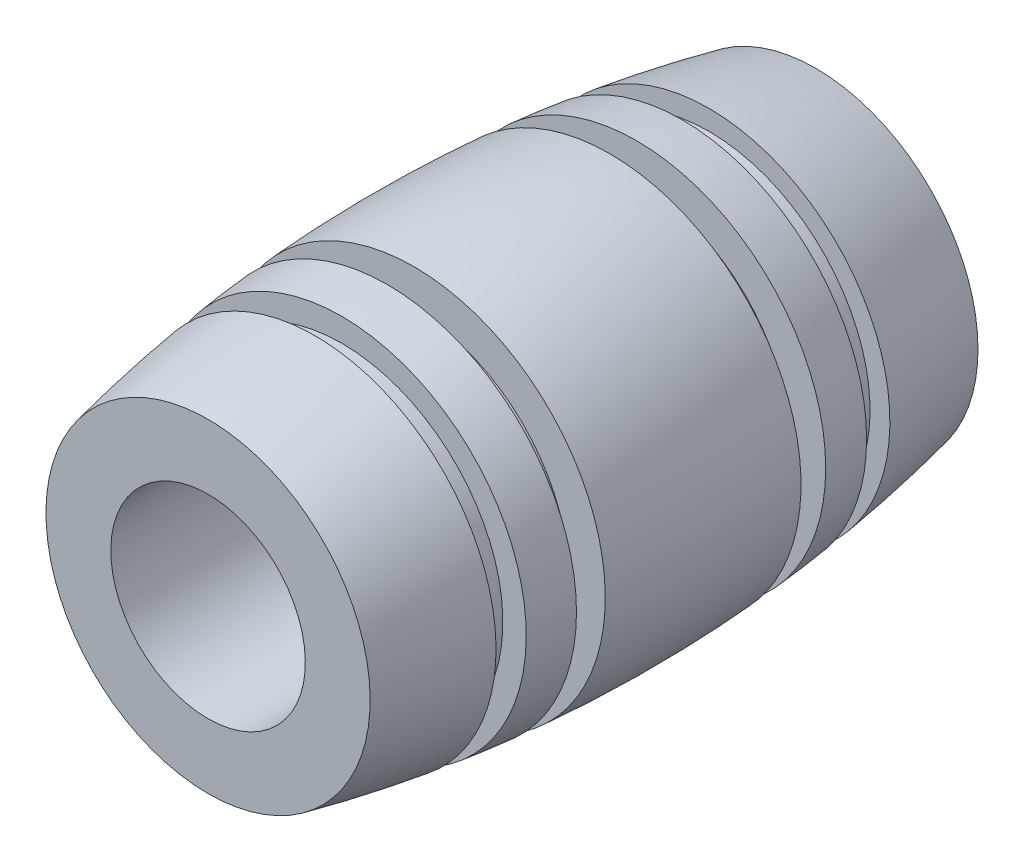
ISO-10303-21;
HEADER;
FILE_DESCRIPTION(('STEP AP214'),'2;1');
FILE_NAME('part.step','',(''),(''),'','','');
FILE_SCHEMA(('AUTOMOTIVE_DESIGN { 1 0 10303 214 1 1 1 1 }'));
ENDSEC;
DATA;
#1=APPLICATION_CONTEXT('core data for automotive mechanical design processes');
#2=APPLICATION_PROTOCOL_DEFINITION('international standard','automotive_design',2000,#1);
#3=PRODUCT_CONTEXT('',#1,'mechanical');
#4=PRODUCT('Part','Part','',(#3));
#5=PRODUCT_RELATED_PRODUCT_CATEGORY('part','',(#4));
#6=PRODUCT_DEFINITION_FORMATION('','',#4);
#7=PRODUCT_DEFINITION_CONTEXT('part definition',#1,'design');
#8=PRODUCT_DEFINITION('design','',#6,#7);
#9=PRODUCT_DEFINITION_SHAPE('','',#8);
#10=(LENGTH_UNIT() NAMED_UNIT(*) SI_UNIT(.MILLI.,.METRE.));
#11=(NAMED_UNIT(*) PLANE_ANGLE_UNIT() SI_UNIT($,.RADIAN.));
#12=(NAMED_UNIT(*) SI_UNIT($,.STERADIAN.) SOLID_ANGLE_UNIT());
#13=UNCERTAINTY_MEASURE_WITH_UNIT(LENGTH_MEASURE(1.E-05),#10,'distance_accuracy_value','');
#14=(GEOMETRIC_REPRESENTATION_CONTEXT(3) GLOBAL_UNCERTAINTY_ASSIGNED_CONTEXT((#13)) GLOBAL_UNIT_ASSIGNED_CONTEXT((#10,
#11,#12)) REPRESENTATION_CONTEXT('',''));
#15=CARTESIAN_POINT('',(0.,0.,0.));
#16=DIRECTION('',(0.,0.,1.));
#17=DIRECTION('',(1.,0.,0.));
#18=AXIS2_PLACEMENT_3D('',#15,#16,#17);
#19=CARTESIAN_POINT('',(0.,0.,0.));
#20=DIRECTION('',(0.,0.,1.));
#21=DIRECTION('',(0.,-1.,0.));
#22=AXIS2_PLACEMENT_3D('',#19,#20,#21);
#23=DEGENERATE_TOROIDAL_SURFACE('',#22,51.2604166666642,59.2604166666642,.F.);
#24=CARTESIAN_POINT('',(0.,0.,8.10000000000001));
#25=DIRECTION('',(0.,0.,1.));
#26=DIRECTION('',(0.,-1.,0.));
#27=AXIS2_PLACEMENT_3D('',#24,#25,#26);
#28=CIRCLE('',#27,7.44381643033361);
#29=CARTESIAN_POINT('',(0.,-7.44381643033362,8.10000000000001));
#30=VERTEX_POINT('',#29);
#31=EDGE_CURVE('E34',#30,#30,#28,.T.);
#32=ORIENTED_EDGE('',*,*,#31,.T.);
#33=EDGE_LOOP('',(#32));
#34=FACE_BOUND('',#33,.T.);
#35=CARTESIAN_POINT('',(0.,0.,12.5));
#36=DIRECTION('',(0.,0.,1.));
#37=DIRECTION('',(0.,-1.,0.));
#38=AXIS2_PLACEMENT_3D('',#35,#36,#37);
#39=CIRCLE('',#38,6.6666666666666);
#40=CARTESIAN_POINT('',(0.,-6.6666666666666,12.5));
#41=VERTEX_POINT('',#40);
#42=EDGE_CURVE('E70',#41,#41,#39,.T.);
#43=ORIENTED_EDGE('',*,*,#42,.F.);
#44=EDGE_LOOP('',(#43));
#45=FACE_BOUND('',#44,.T.);
#46=ADVANCED_FACE('F30',(#34,#45),#23,.F.);
#47=CARTESIAN_POINT('',(0.,0.,-8.09999999999999));
#48=DIRECTION('',(0.,0.,-1.));
#49=DIRECTION('',(0.,1.,0.));
#50=AXIS2_PLACEMENT_3D('',#47,#48,#49);
#51=CIRCLE('',#50,7.44381643033364);
#52=CARTESIAN_POINT('',(0.,7.44381643033364,-8.09999999999999));
#53=VERTEX_POINT('',#52);
#54=EDGE_CURVE('E60',#53,#53,#51,.T.);
#55=ORIENTED_EDGE('',*,*,#54,.T.);
#56=EDGE_LOOP('',(#55));
#57=FACE_BOUND('',#56,.T.);
#58=CARTESIAN_POINT('',(0.,0.,-12.5));
#59=DIRECTION('',(0.,0.,1.));
#60=DIRECTION('',(0.,-1.,0.));
#61=AXIS2_PLACEMENT_3D('',#58,#59,#60);
#62=CIRCLE('',#61,6.66666666666667);
#63=CARTESIAN_POINT('',(0.,-6.66666666666666,-12.5));
#64=VERTEX_POINT('',#63);
#65=EDGE_CURVE('E10',#64,#64,#62,.T.);
#66=ORIENTED_EDGE('',*,*,#65,.T.);
#67=EDGE_LOOP('',(#66));
#68=FACE_BOUND('',#67,.T.);
#69=ADVANCED_FACE('F121',(#57,#68),#23,.F.);
#70=CARTESIAN_POINT('',(0.,4.,-12.5));
#71=DIRECTION('',(0.,0.,1.));
#72=DIRECTION('',(0.,-1.,0.));
#73=AXIS2_PLACEMENT_3D('',#70,#71,#72);
#74=PLANE('',#73);
#75=ORIENTED_EDGE('',*,*,#65,.F.);
#76=EDGE_LOOP('',(#75));
#77=FACE_BOUND('',#76,.T.);
#78=CARTESIAN_POINT('',(0.,0.,-12.5));
#79=DIRECTION('',(0.,0.,1.));
#80=DIRECTION('',(0.,-1.,0.));
#81=AXIS2_PLACEMENT_3D('',#78,#79,#80);
#82=CIRCLE('',#81,4.);
#83=CARTESIAN_POINT('',(0.,-3.99999999999999,-12.5));
#84=VERTEX_POINT('',#83);
#85=EDGE_CURVE('E38',#84,#84,#82,.T.);
#86=ORIENTED_EDGE('',*,*,#85,.T.);
#87=EDGE_LOOP('',(#86));
#88=FACE_BOUND('',#87,.T.);
#89=ADVANCED_FACE('F126',(#77,#88),#74,.F.);
#90=CARTESIAN_POINT('',(0.,0.,12.5));
#91=DIRECTION('',(0.,0.,1.));
#92=DIRECTION('',(0.,-1.,0.));
#93=AXIS2_PLACEMENT_3D('',#90,#91,#92);
#94=CYLINDRICAL_SURFACE('',#93,4.);
#95=ORIENTED_EDGE('',*,*,#85,.F.);
#96=EDGE_LOOP('',(#95));
#97=FACE_BOUND('',#96,.T.);
#98=CARTESIAN_POINT('',(0.,0.,12.5));
#99=DIRECTION('',(0.,0.,1.));
#100=DIRECTION('',(0.,-1.,0.));
#101=AXIS2_PLACEMENT_3D('',#98,#99,#100);
#102=CIRCLE('',#101,4.);
#103=CARTESIAN_POINT('',(0.,-4.,12.5));
#104=VERTEX_POINT('',#103);
#105=EDGE_CURVE('E43',#104,#104,#102,.T.);
#106=ORIENTED_EDGE('',*,*,#105,.T.);
#107=EDGE_LOOP('',(#106));
#108=FACE_BOUND('',#107,.T.);
#109=ADVANCED_FACE('F164',(#97,#108),#94,.F.);
#110=CARTESIAN_POINT('',(0.,6.6666666666666,12.5));
#111=DIRECTION('',(0.,0.,-1.));
#112=DIRECTION('',(0.,1.,0.));
#113=AXIS2_PLACEMENT_3D('',#110,#111,#112);
#114=PLANE('',#113);
#115=ORIENTED_EDGE('',*,*,#105,.F.);
#116=EDGE_LOOP('',(#115));
#117=FACE_BOUND('',#116,.T.);
#118=ORIENTED_EDGE('',*,*,#42,.T.);
#119=EDGE_LOOP('',(#118));
#120=FACE_BOUND('',#119,.T.);
#121=ADVANCED_FACE('F160',(#117,#120),#114,.F.);
#122=CARTESIAN_POINT('',(0.,-8.,-7.));
#123=DIRECTION('',(0.,0.,1.));
#124=DIRECTION('',(0.,-1.,0.));
#125=AXIS2_PLACEMENT_3D('',#122,#123,#124);
#126=PLANE('',#125);
#127=CARTESIAN_POINT('',(0.,0.,-7.));
#128=DIRECTION('',(0.,0.,1.));
#129=DIRECTION('',(0.,-1.,0.));
#130=AXIS2_PLACEMENT_3D('',#127,#128,#129);
#131=CIRCLE('',#130,6.625);
#132=CARTESIAN_POINT('',(0.,-6.625,-7.));
#133=VERTEX_POINT('',#132);
#134=EDGE_CURVE('E92',#133,#133,#131,.T.);
#135=ORIENTED_EDGE('',*,*,#134,.T.);
#136=EDGE_LOOP('',(#135));
#137=FACE_BOUND('',#136,.T.);
#138=CARTESIAN_POINT('',(0.,0.,-6.99999999999999));
#139=DIRECTION('',(0.,0.,1.));
#140=DIRECTION('',(0.,-1.,0.));
#141=AXIS2_PLACEMENT_3D('',#138,#139,#140);
#142=CIRCLE('',#141,7.58511828295331);
#143=CARTESIAN_POINT('',(0.,-7.58511828295331,-7.));
#144=VERTEX_POINT('',#143);
#145=EDGE_CURVE('E63',#144,#144,#142,.T.);
#146=ORIENTED_EDGE('',*,*,#145,.F.);
#147=EDGE_LOOP('',(#146));
#148=FACE_BOUND('',#147,.T.);
#149=ADVANCED_FACE('F163',(#137,#148),#126,.F.);
#150=CARTESIAN_POINT('',(0.,-8.,-8.1));
#151=DIRECTION('',(0.,0.,-1.));
#152=DIRECTION('',(0.,1.,0.));
#153=AXIS2_PLACEMENT_3D('',#150,#151,#152);
#154=PLANE('',#153);
#155=CARTESIAN_POINT('',(0.,0.,-8.1));
#156=DIRECTION('',(0.,0.,1.));
#157=DIRECTION('',(0.,-1.,0.));
#158=AXIS2_PLACEMENT_3D('',#155,#156,#157);
#159=CIRCLE('',#158,6.625);
#160=CARTESIAN_POINT('',(0.,-6.625,-8.1));
#161=VERTEX_POINT('',#160);
#162=EDGE_CURVE('E89',#161,#161,#159,.T.);
#163=ORIENTED_EDGE('',*,*,#162,.F.);
#164=EDGE_LOOP('',(#163));
#165=FACE_BOUND('',#164,.T.);
#166=ORIENTED_EDGE('',*,*,#54,.F.);
#167=EDGE_LOOP('',(#166));
#168=FACE_BOUND('',#167,.T.);
#169=ADVANCED_FACE('F192',(#165,#168),#154,.F.);
#170=CARTESIAN_POINT('',(0.,0.,12.5));
#171=DIRECTION('',(0.,0.,1.));
#172=DIRECTION('',(0.,-1.,0.));
#173=AXIS2_PLACEMENT_3D('',#170,#171,#172);
#174=CYLINDRICAL_SURFACE('',#173,6.625);
#175=ORIENTED_EDGE('',*,*,#134,.F.);
#176=EDGE_LOOP('',(#175));
#177=FACE_BOUND('',#176,.T.);
#178=ORIENTED_EDGE('',*,*,#162,.T.);
#179=EDGE_LOOP('',(#178));
#180=FACE_BOUND('',#179,.T.);
#181=ADVANCED_FACE('F117',(#177,#180),#174,.T.);
#182=CARTESIAN_POINT('',(0.,-8.,8.10000000000001));
#183=DIRECTION('',(0.,0.,1.));
#184=DIRECTION('',(0.,-1.,0.));
#185=AXIS2_PLACEMENT_3D('',#182,#183,#184);
#186=PLANE('',#185);
#187=CARTESIAN_POINT('',(0.,0.,8.10000000000001));
#188=DIRECTION('',(0.,0.,1.));
#189=DIRECTION('',(0.,-1.,0.));
#190=AXIS2_PLACEMENT_3D('',#187,#188,#189);
#191=CIRCLE('',#190,6.625);
#192=CARTESIAN_POINT('',(0.,-6.625,8.1));
#193=VERTEX_POINT('',#192);
#194=EDGE_CURVE('E51',#193,#193,#191,.T.);
#195=ORIENTED_EDGE('',*,*,#194,.T.);
#196=EDGE_LOOP('',(#195));
#197=FACE_BOUND('',#196,.T.);
#198=ORIENTED_EDGE('',*,*,#31,.F.);
#199=EDGE_LOOP('',(#198));
#200=FACE_BOUND('',#199,.T.);
#201=ADVANCED_FACE('F108',(#197,#200),#186,.F.);
#202=CARTESIAN_POINT('',(0.,-8.,7.00000000000001));
#203=DIRECTION('',(0.,0.,-1.));
#204=DIRECTION('',(0.,1.,0.));
#205=AXIS2_PLACEMENT_3D('',#202,#203,#204);
#206=PLANE('',#205);
#207=CARTESIAN_POINT('',(0.,0.,7.00000000000001));
#208=DIRECTION('',(0.,0.,1.));
#209=DIRECTION('',(0.,-1.,0.));
#210=AXIS2_PLACEMENT_3D('',#207,#208,#209);
#211=CIRCLE('',#210,6.625);
#212=CARTESIAN_POINT('',(0.,-6.625,7.00000000000001));
#213=VERTEX_POINT('',#212);
#214=EDGE_CURVE('E95',#213,#213,#211,.T.);
#215=ORIENTED_EDGE('',*,*,#214,.F.);
#216=EDGE_LOOP('',(#215));
#217=FACE_BOUND('',#216,.T.);
#218=CARTESIAN_POINT('',(0.,0.,7.00000000000001));
#219=DIRECTION('',(0.,0.,-1.));
#220=DIRECTION('',(0.,1.,0.));
#221=AXIS2_PLACEMENT_3D('',#218,#219,#220);
#222=CIRCLE('',#221,7.58511828295329);
#223=CARTESIAN_POINT('',(0.,7.58511828295329,7.00000000000001));
#224=VERTEX_POINT('',#223);
#225=EDGE_CURVE('E65',#224,#224,#222,.T.);
#226=ORIENTED_EDGE('',*,*,#225,.F.);
#227=EDGE_LOOP('',(#226));
#228=FACE_BOUND('',#227,.T.);
#229=ADVANCED_FACE('F105',(#217,#228),#206,.F.);
#230=CARTESIAN_POINT('',(0.,0.,12.5));
#231=DIRECTION('',(0.,0.,1.));
#232=DIRECTION('',(0.,-1.,0.));
#233=AXIS2_PLACEMENT_3D('',#230,#231,#232);
#234=CYLINDRICAL_SURFACE('',#233,6.625);
#235=ORIENTED_EDGE('',*,*,#194,.F.);
#236=EDGE_LOOP('',(#235));
#237=FACE_BOUND('',#236,.T.);
#238=ORIENTED_EDGE('',*,*,#214,.T.);
#239=EDGE_LOOP('',(#238));
#240=FACE_BOUND('',#239,.T.);
#241=ADVANCED_FACE('F103',(#237,#240),#234,.T.);
#242=ORIENTED_EDGE('',*,*,#225,.T.);
#243=EDGE_LOOP('',(#242));
#244=FACE_BOUND('',#243,.T.);
#245=CARTESIAN_POINT('',(0.,0.,5.12500000000001));
#246=DIRECTION('',(0.,0.,1.));
#247=DIRECTION('',(0.,-1.,0.));
#248=AXIS2_PLACEMENT_3D('',#245,#246,#247);
#249=CIRCLE('',#248,7.77797218759447);
#250=CARTESIAN_POINT('',(0.,-7.77797218759447,5.125));
#251=VERTEX_POINT('',#250);
#252=EDGE_CURVE('E50',#251,#251,#249,.T.);
#253=ORIENTED_EDGE('',*,*,#252,.T.);
#254=EDGE_LOOP('',(#253));
#255=FACE_BOUND('',#254,.T.);
#256=ADVANCED_FACE('F114',(#244,#255),#23,.F.);
#257=ORIENTED_EDGE('',*,*,#145,.T.);
#258=EDGE_LOOP('',(#257));
#259=FACE_BOUND('',#258,.T.);
#260=CARTESIAN_POINT('',(0.,0.,-5.12499999999999));
#261=DIRECTION('',(0.,0.,-1.));
#262=DIRECTION('',(0.,1.,0.));
#263=AXIS2_PLACEMENT_3D('',#260,#261,#262);
#264=CIRCLE('',#263,7.77797218759448);
#265=CARTESIAN_POINT('',(0.,7.77797218759448,-5.12499999999999));
#266=VERTEX_POINT('',#265);
#267=EDGE_CURVE('E57',#266,#266,#264,.T.);
#268=ORIENTED_EDGE('',*,*,#267,.T.);
#269=EDGE_LOOP('',(#268));
#270=FACE_BOUND('',#269,.T.);
#271=ADVANCED_FACE('F122',(#259,#270),#23,.F.);
#272=CARTESIAN_POINT('',(0.,-8.,5.125));
#273=DIRECTION('',(0.,0.,1.));
#274=DIRECTION('',(0.,-1.,0.));
#275=AXIS2_PLACEMENT_3D('',#272,#273,#274);
#276=PLANE('',#275);
#277=CARTESIAN_POINT('',(0.,0.,5.12500000000001));
#278=DIRECTION('',(0.,0.,1.));
#279=DIRECTION('',(0.,-1.,0.));
#280=AXIS2_PLACEMENT_3D('',#277,#278,#279);
#281=CIRCLE('',#280,6.35000000000001);
#282=CARTESIAN_POINT('',(0.,-6.35000000000001,5.125));
#283=VERTEX_POINT('',#282);
#284=EDGE_CURVE('E79',#283,#283,#281,.T.);
#285=ORIENTED_EDGE('',*,*,#284,.T.);
#286=EDGE_LOOP('',(#285));
#287=FACE_BOUND('',#286,.T.);
#288=ORIENTED_EDGE('',*,*,#252,.F.);
#289=EDGE_LOOP('',(#288));
#290=FACE_BOUND('',#289,.T.);
#291=ADVANCED_FACE('F130',(#287,#290),#276,.F.);
#292=CARTESIAN_POINT('',(0.,-8.00000000000001,4.025));
#293=DIRECTION('',(0.,0.,-1.));
#294=DIRECTION('',(0.,1.,0.));
#295=AXIS2_PLACEMENT_3D('',#292,#293,#294);
#296=PLANE('',#295);
#297=CARTESIAN_POINT('',(0.,0.,4.02500000000001));
#298=DIRECTION('',(0.,0.,1.));
#299=DIRECTION('',(0.,-1.,0.));
#300=AXIS2_PLACEMENT_3D('',#297,#298,#299);
#301=CIRCLE('',#300,6.35000000000001);
#302=CARTESIAN_POINT('',(0.,-6.35000000000001,4.025));
#303=VERTEX_POINT('',#302);
#304=EDGE_CURVE('E83',#303,#303,#301,.T.);
#305=ORIENTED_EDGE('',*,*,#304,.F.);
#306=EDGE_LOOP('',(#305));
#307=FACE_BOUND('',#306,.T.);
#308=CARTESIAN_POINT('',(0.,0.,4.02500000000001));
#309=DIRECTION('',(0.,0.,-1.));
#310=DIRECTION('',(0.,1.,0.));
#311=AXIS2_PLACEMENT_3D('',#308,#309,#310);
#312=CIRCLE('',#311,7.86315188688857);
#313=CARTESIAN_POINT('',(0.,7.86315188688857,4.02500000000001));
#314=VERTEX_POINT('',#313);
#315=EDGE_CURVE('E47',#314,#314,#312,.T.);
#316=ORIENTED_EDGE('',*,*,#315,.F.);
#317=EDGE_LOOP('',(#316));
#318=FACE_BOUND('',#317,.T.);
#319=ADVANCED_FACE('F149',(#307,#318),#296,.F.);
#320=CARTESIAN_POINT('',(0.,0.,12.5));
#321=DIRECTION('',(0.,0.,1.));
#322=DIRECTION('',(0.,-1.,0.));
#323=AXIS2_PLACEMENT_3D('',#320,#321,#322);
#324=CYLINDRICAL_SURFACE('',#323,6.35000000000001);
#325=ORIENTED_EDGE('',*,*,#284,.F.);
#326=EDGE_LOOP('',(#325));
#327=FACE_BOUND('',#326,.T.);
#328=ORIENTED_EDGE('',*,*,#304,.T.);
#329=EDGE_LOOP('',(#328));
#330=FACE_BOUND('',#329,.T.);
#331=ADVANCED_FACE('F155',(#327,#330),#324,.T.);
#332=CARTESIAN_POINT('',(0.,-8.,-5.125));
#333=DIRECTION('',(0.,0.,-1.));
#334=DIRECTION('',(0.,1.,0.));
#335=AXIS2_PLACEMENT_3D('',#332,#333,#334);
#336=PLANE('',#335);
#337=CARTESIAN_POINT('',(0.,0.,-5.12499999999999));
#338=DIRECTION('',(0.,0.,1.));
#339=DIRECTION('',(0.,-1.,0.));
#340=AXIS2_PLACEMENT_3D('',#337,#338,#339);
#341=CIRCLE('',#340,6.35000000000002);
#342=CARTESIAN_POINT('',(0.,-6.35000000000002,-5.12499999999999));
#343=VERTEX_POINT('',#342);
#344=EDGE_CURVE('E86',#343,#343,#341,.T.);
#345=ORIENTED_EDGE('',*,*,#344,.F.);
#346=EDGE_LOOP('',(#345));
#347=FACE_BOUND('',#346,.T.);
#348=ORIENTED_EDGE('',*,*,#267,.F.);
#349=EDGE_LOOP('',(#348));
#350=FACE_BOUND('',#349,.T.);
#351=ADVANCED_FACE('F253',(#347,#350),#336,.F.);
#352=CARTESIAN_POINT('',(0.,-8.00000000000001,-4.025));
#353=DIRECTION('',(0.,0.,1.));
#354=DIRECTION('',(0.,-1.,0.));
#355=AXIS2_PLACEMENT_3D('',#352,#353,#354);
#356=PLANE('',#355);
#357=CARTESIAN_POINT('',(0.,0.,-4.025));
#358=DIRECTION('',(0.,0.,1.));
#359=DIRECTION('',(0.,-1.,0.));
#360=AXIS2_PLACEMENT_3D('',#357,#358,#359);
#361=CIRCLE('',#360,6.35000000000002);
#362=CARTESIAN_POINT('',(0.,-6.35000000000002,-4.025));
#363=VERTEX_POINT('',#362);
#364=EDGE_CURVE('E82',#363,#363,#361,.T.);
#365=ORIENTED_EDGE('',*,*,#364,.T.);
#366=EDGE_LOOP('',(#365));
#367=FACE_BOUND('',#366,.T.);
#368=CARTESIAN_POINT('',(0.,0.,-4.025));
#369=DIRECTION('',(0.,0.,1.));
#370=DIRECTION('',(0.,-1.,0.));
#371=AXIS2_PLACEMENT_3D('',#368,#369,#370);
#372=CIRCLE('',#371,7.86315188688858);
#373=CARTESIAN_POINT('',(0.,-7.86315188688858,-4.025));
#374=VERTEX_POINT('',#373);
#375=EDGE_CURVE('E54',#374,#374,#372,.T.);
#376=ORIENTED_EDGE('',*,*,#375,.F.);
#377=EDGE_LOOP('',(#376));
#378=FACE_BOUND('',#377,.T.);
#379=ADVANCED_FACE('F138',(#367,#378),#356,.F.);
#380=CARTESIAN_POINT('',(0.,0.,12.5));
#381=DIRECTION('',(0.,0.,1.));
#382=DIRECTION('',(0.,-1.,0.));
#383=AXIS2_PLACEMENT_3D('',#380,#381,#382);
#384=CYLINDRICAL_SURFACE('',#383,6.35000000000002);
#385=ORIENTED_EDGE('',*,*,#364,.F.);
#386=EDGE_LOOP('',(#385));
#387=FACE_BOUND('',#386,.T.);
#388=ORIENTED_EDGE('',*,*,#344,.T.);
#389=EDGE_LOOP('',(#388));
#390=FACE_BOUND('',#389,.T.);
#391=ADVANCED_FACE('F133',(#387,#390),#384,.T.);
#392=ORIENTED_EDGE('',*,*,#375,.T.);
#393=EDGE_LOOP('',(#392));
#394=FACE_BOUND('',#393,.T.);
#395=ORIENTED_EDGE('',*,*,#315,.T.);
#396=EDGE_LOOP('',(#395));
#397=FACE_BOUND('',#396,.T.);
#398=ADVANCED_FACE('F32',(#394,#397),#23,.F.);
#399=CLOSED_SHELL('',(#46,#69,#89,#109,#121,#149,#169,#181,#201,#229,#241,#256,#271,#291,#319,
#331,#351,#379,#391,#398));
#400=MANIFOLD_SOLID_BREP('B2',#399);
#401=ADVANCED_BREP_SHAPE_REPRESENTATION('',(#18,#400),#14);
#402=SHAPE_DEFINITION_REPRESENTATION(#9,#401);
ENDSEC;
END-ISO-10303-21;
